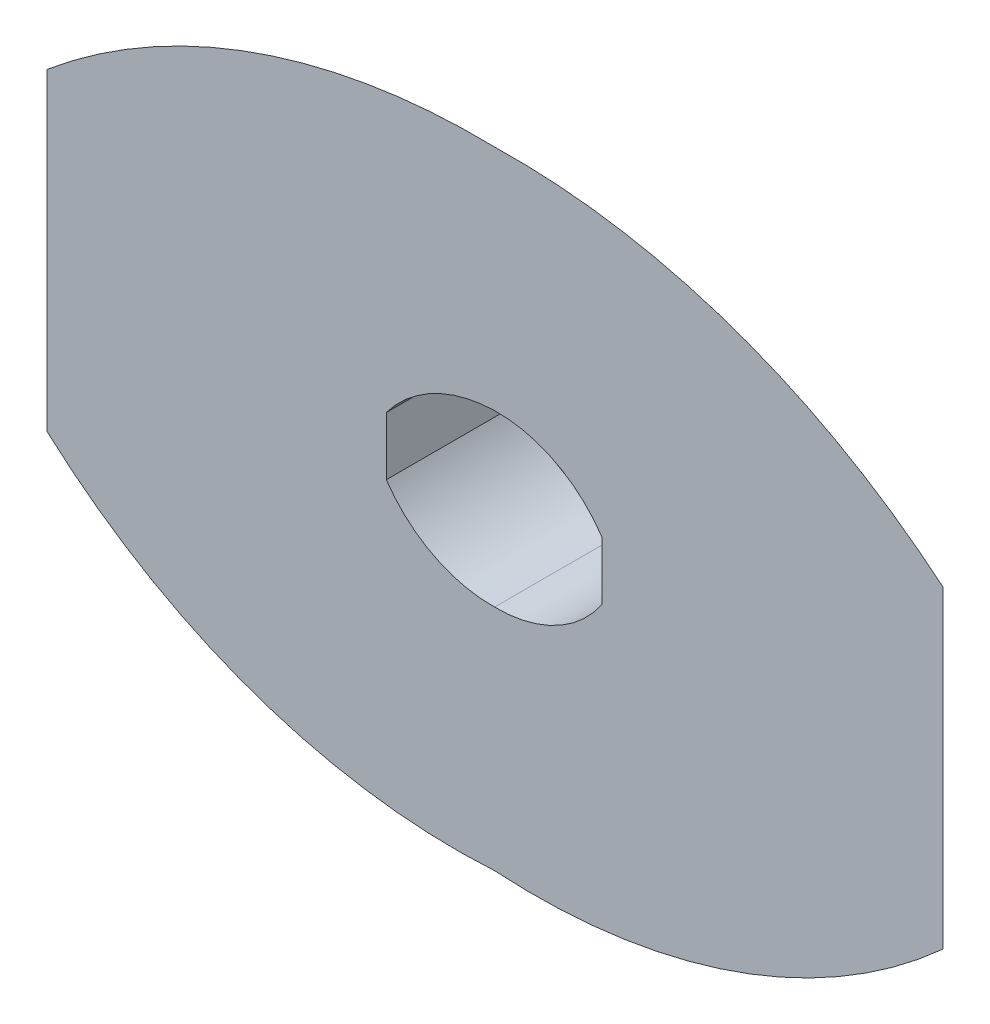
ISO-10303-21;
HEADER;
FILE_DESCRIPTION(('STEP AP214'),'2;1');
FILE_NAME('part.step','',(''),(''),'','','');
FILE_SCHEMA(('AUTOMOTIVE_DESIGN { 1 0 10303 214 1 1 1 1 }'));
ENDSEC;
DATA;
#1=APPLICATION_CONTEXT('core data for automotive mechanical design processes');
#2=APPLICATION_PROTOCOL_DEFINITION('international standard','automotive_design',2000,#1);
#3=PRODUCT_CONTEXT('',#1,'mechanical');
#4=PRODUCT('Part','Part','',(#3));
#5=PRODUCT_RELATED_PRODUCT_CATEGORY('part','',(#4));
#6=PRODUCT_DEFINITION_FORMATION('','',#4);
#7=PRODUCT_DEFINITION_CONTEXT('part definition',#1,'design');
#8=PRODUCT_DEFINITION('design','',#6,#7);
#9=PRODUCT_DEFINITION_SHAPE('','',#8);
#10=(LENGTH_UNIT() NAMED_UNIT(*) SI_UNIT(.MILLI.,.METRE.));
#11=(NAMED_UNIT(*) PLANE_ANGLE_UNIT() SI_UNIT($,.RADIAN.));
#12=(NAMED_UNIT(*) SI_UNIT($,.STERADIAN.) SOLID_ANGLE_UNIT());
#13=UNCERTAINTY_MEASURE_WITH_UNIT(LENGTH_MEASURE(1.E-05),#10,'distance_accuracy_value','');
#14=(GEOMETRIC_REPRESENTATION_CONTEXT(3) GLOBAL_UNCERTAINTY_ASSIGNED_CONTEXT((#13)) GLOBAL_UNIT_ASSIGNED_CONTEXT((#10,
#11,#12)) REPRESENTATION_CONTEXT('',''));
#15=CARTESIAN_POINT('',(0.,0.,0.));
#16=DIRECTION('',(0.,0.,1.));
#17=DIRECTION('',(1.,0.,0.));
#18=AXIS2_PLACEMENT_3D('',#15,#16,#17);
#19=CARTESIAN_POINT('',(24.6149633025542,-9.10927045909589,30.));
#20=DIRECTION('',(0.,0.,-1.));
#21=DIRECTION('',(-1.,0.,0.));
#22=AXIS2_PLACEMENT_3D('',#19,#20,#21);
#23=PLANE('',#22);
#24=DIRECTION('',(0.,1.,0.));
#25=VECTOR('',#24,1.);
#26=CARTESIAN_POINT('',(124.185565628365,-0.0622981882444848,30.));
#27=LINE('',#26,#25);
#28=CARTESIAN_POINT('',(124.185565628365,-35.0622981882445,30.));
#29=VERTEX_POINT('',#28);
#30=CARTESIAN_POINT('',(124.185565628365,34.9377018117555,30.));
#31=VERTEX_POINT('',#30);
#32=EDGE_CURVE('E598',#29,#31,#27,.T.);
#33=ORIENTED_EDGE('',*,*,#32,.T.);
#34=CARTESIAN_POINT('',(27.6116358621101,-80.3444625126298,30.));
#35=DIRECTION('',(0.,0.,1.));
#36=DIRECTION('',(-1.,0.,0.));
#37=AXIS2_PLACEMENT_3D('',#34,#35,#36);
#38=CIRCLE('',#37,150.387836349261);
#39=CARTESIAN_POINT('',(24.0000000000001,70.,30.));
#40=VERTEX_POINT('',#39);
#41=EDGE_CURVE('E476',#31,#40,#38,.T.);
#42=ORIENTED_EDGE('',*,*,#41,.T.);
#43=CARTESIAN_POINT('',(20.5234772685394,-80.4242207672556,30.));
#44=DIRECTION('',(0.,0.,1.));
#45=DIRECTION('',(-1.,0.,0.));
#46=AXIS2_PLACEMENT_3D('',#43,#44,#45);
#47=CIRCLE('',#46,150.464389154838);
#48=CARTESIAN_POINT('',(-76.,35.,30.));
#49=VERTEX_POINT('',#48);
#50=EDGE_CURVE('E463',#40,#49,#47,.T.);
#51=ORIENTED_EDGE('',*,*,#50,.T.);
#52=DIRECTION('',(0.,-1.,0.));
#53=VECTOR('',#52,1.);
#54=CARTESIAN_POINT('',(-76.,0.,30.));
#55=LINE('',#54,#53);
#56=CARTESIAN_POINT('',(-76.,-35.,30.));
#57=VERTEX_POINT('',#56);
#58=EDGE_CURVE('E455',#49,#57,#55,.T.);
#59=ORIENTED_EDGE('',*,*,#58,.T.);
#60=CARTESIAN_POINT('',(15.5928244593314,66.3366413123755,30.));
#61=DIRECTION('',(0.,0.,1.));
#62=DIRECTION('',(-1.,0.,0.));
#63=AXIS2_PLACEMENT_3D('',#60,#61,#62);
#64=CIRCLE('',#63,136.595608878584);
#65=CARTESIAN_POINT('',(24.0000000000001,-70.,30.));
#66=VERTEX_POINT('',#65);
#67=EDGE_CURVE('E451',#57,#66,#64,.T.);
#68=ORIENTED_EDGE('',*,*,#67,.T.);
#69=CARTESIAN_POINT('',(32.8055514157432,65.8620026125545,30.));
#70=DIRECTION('',(0.,0.,1.));
#71=DIRECTION('',(-1.,0.,0.));
#72=AXIS2_PLACEMENT_3D('',#69,#70,#71);
#73=CIRCLE('',#72,136.147058321614);
#74=EDGE_CURVE('E258',#66,#29,#73,.T.);
#75=ORIENTED_EDGE('',*,*,#74,.T.);
#76=EDGE_LOOP('',(#33,#42,#51,#59,#68,#75));
#77=FACE_BOUND('',#76,.T.);
#78=CARTESIAN_POINT('',(24.6149633025542,-9.10927045909589,30.));
#79=DIRECTION('',(0.,0.,1.));
#80=DIRECTION('',(-1.,0.,0.));
#81=AXIS2_PLACEMENT_3D('',#78,#79,#80);
#82=CIRCLE('',#81,28.1159966141357);
#83=CARTESIAN_POINT('',(48.,6.5,30.));
#84=VERTEX_POINT('',#83);
#85=CARTESIAN_POINT('',(24.,19.,30.));
#86=VERTEX_POINT('',#85);
#87=EDGE_CURVE('E240',#84,#86,#82,.T.);
#88=ORIENTED_EDGE('',*,*,#87,.F.);
#89=DIRECTION('',(0.,1.,0.));
#90=VECTOR('',#89,1.);
#91=CARTESIAN_POINT('',(48.,-6.5,30.));
#92=LINE('',#91,#90);
#93=CARTESIAN_POINT('',(48.,-6.5,30.));
#94=VERTEX_POINT('',#93);
#95=EDGE_CURVE('E275',#94,#84,#92,.T.);
#96=ORIENTED_EDGE('',*,*,#95,.F.);
#97=CARTESIAN_POINT('',(24.3946012008228,9.53236569442032,30.));
#98=DIRECTION('',(0.,0.,1.));
#99=DIRECTION('',(-1.,0.,0.));
#100=AXIS2_PLACEMENT_3D('',#97,#98,#99);
#101=CIRCLE('',#100,28.5350942214639);
#102=CARTESIAN_POINT('',(24.,-19.,30.));
#103=VERTEX_POINT('',#102);
#104=EDGE_CURVE('E272',#103,#94,#101,.T.);
#105=ORIENTED_EDGE('',*,*,#104,.F.);
#106=CARTESIAN_POINT('',(23.4409098940042,9.51422638055253,30.));
#107=DIRECTION('',(0.,0.,1.));
#108=DIRECTION('',(1.,0.,0.));
#109=AXIS2_PLACEMENT_3D('',#106,#107,#108);
#110=CIRCLE('',#109,28.5197070081027);
#111=CARTESIAN_POINT('',(-0.188408081401335,-6.45540166286783,30.));
#112=VERTEX_POINT('',#111);
#113=EDGE_CURVE('E267',#112,#103,#110,.T.);
#114=ORIENTED_EDGE('',*,*,#113,.F.);
#115=DIRECTION('',(0.,-1.,0.));
#116=VECTOR('',#115,1.);
#117=CARTESIAN_POINT('',(-0.188408081401328,-6.45540166286783,30.));
#118=LINE('',#117,#116);
#119=CARTESIAN_POINT('',(-0.188408081401328,6.54459833713217,30.));
#120=VERTEX_POINT('',#119);
#121=EDGE_CURVE('E263',#120,#112,#118,.T.);
#122=ORIENTED_EDGE('',*,*,#121,.F.);
#123=CARTESIAN_POINT('',(24.6789306964681,-12.0331470036309,30.));
#124=DIRECTION('',(0.,0.,1.));
#125=DIRECTION('',(-1.,0.,0.));
#126=AXIS2_PLACEMENT_3D('',#123,#124,#125);
#127=CIRCLE('',#126,31.040572801409);
#128=EDGE_CURVE('E249',#86,#120,#127,.T.);
#129=ORIENTED_EDGE('',*,*,#128,.F.);
#130=EDGE_LOOP('',(#88,#96,#105,#114,#122,#129));
#131=FACE_BOUND('',#130,.T.);
#132=ADVANCED_FACE('F165',(#77,#131),#23,.F.);
#133=CARTESIAN_POINT('',(48.,-6.5,0.));
#134=DIRECTION('',(0.366392407074841,0.,-0.93046042583116));
#135=DIRECTION('',(0.,1.,0.));
#136=AXIS2_PLACEMENT_3D('',#133,#134,#135);
#137=PLANE('',#136);
#138=CARTESIAN_POINT('',(48.,-6.50000000000001,0.));
#139=DIRECTION('',(0.,1.,0.));
#140=VECTOR('',#139,1.);
#141=LINE('',#138,#140);
#142=CARTESIAN_POINT('',(48.,-6.5,0.));
#143=VERTEX_POINT('',#142);
#144=CARTESIAN_POINT('',(48.,6.5,0.));
#145=VERTEX_POINT('',#144);
#146=EDGE_CURVE('E12',#143,#145,#141,.T.);
#147=ORIENTED_EDGE('',*,*,#146,.T.);
#148=DIRECTION('',(0.878957023448894,0.328087315911214,0.34611163526821));
#149=VECTOR('',#148,1.);
#150=CARTESIAN_POINT('',(86.0927828141823,20.7188509058777,15.));
#151=LINE('',#150,#149);
#152=EDGE_CURVE('E527',#145,#31,#151,.T.);
#153=ORIENTED_EDGE('',*,*,#152,.T.);
#154=ORIENTED_EDGE('',*,*,#32,.F.);
#155=DIRECTION('',(0.878541878238959,-0.329369151362959,0.345948161305717));
#156=VECTOR('',#155,1.);
#157=CARTESIAN_POINT('',(86.0927828141823,-20.7811490941222,15.));
#158=LINE('',#157,#156);
#159=EDGE_CURVE('E577',#143,#29,#158,.T.);
#160=ORIENTED_EDGE('',*,*,#159,.F.);
#161=EDGE_LOOP('',(#147,#153,#154,#160));
#162=FACE_BOUND('',#161,.T.);
#163=ADVANCED_FACE('F301',(#162),#137,.T.);
#164=CARTESIAN_POINT('',(48.,6.5,0.));
#165=CARTESIAN_POINT('',(124.185565628365,34.9377018117555,30.));
#166=CARTESIAN_POINT('',(46.6938965379214,8.45673958442884,0.));
#167=CARTESIAN_POINT('',(117.255780952948,40.7429063068397,30.));
#168=CARTESIAN_POINT('',(43.5882224493372,12.0406958862123,0.));
#169=CARTESIAN_POINT('',(102.346855193951,51.1005017731215,30.));
#170=CARTESIAN_POINT('',(37.7398565174825,16.0905245135667,0.));
#171=CARTESIAN_POINT('',(77.5589852438945,62.3730348569333,30.));
#172=CARTESIAN_POINT('',(31.0689807560508,18.5611342681323,0.));
#173=CARTESIAN_POINT('',(51.1514301850644,69.0175464718968,30.));
#174=CARTESIAN_POINT('',(26.3520391654009,19.05145696595,0.));
#175=CARTESIAN_POINT('',(33.0374322728898,70.2171008758997,30.));
#176=CARTESIAN_POINT('',(24.,19.,0.));
#177=CARTESIAN_POINT('',(24.0000000000001,70.,30.));
#178=B_SPLINE_SURFACE_WITH_KNOTS('',3,1,((#164,#165),(#166,#167),(#168,#169),(#170,#171),(#172,
#173),(#174,#175),(#176,#177)),.UNSPECIFIED.,.F.,.F.,.F.,(4,1,1,1,4),(2,2),(0.,0.25,0.5,0.75,
1.),(0.,1.),.UNSPECIFIED.);
#179=CARTESIAN_POINT('',(48.,6.5,0.));
#180=CARTESIAN_POINT('',(46.6938965379214,8.45673958442884,0.));
#181=CARTESIAN_POINT('',(43.5882224493372,12.0406958862123,0.));
#182=CARTESIAN_POINT('',(37.7398565174825,16.0905245135667,0.));
#183=CARTESIAN_POINT('',(31.0689807560508,18.5611342681323,0.));
#184=CARTESIAN_POINT('',(26.3520391654009,19.05145696595,0.));
#185=CARTESIAN_POINT('',(24.,19.,0.));
#186=B_SPLINE_CURVE_WITH_KNOTS('',3,(#179,#180,#181,#182,#183,#184,#185),.UNSPECIFIED.,.F.,.F.,
(4,1,1,1,4),(0.,0.25,0.5,0.75,1.),.UNSPECIFIED.);
#187=CARTESIAN_POINT('',(24.,19.,0.));
#188=VERTEX_POINT('',#187);
#189=EDGE_CURVE('E192',#145,#188,#186,.T.);
#190=DIRECTION('',(0.,0.86193421515777,0.507020126563394));
#191=VECTOR('',#190,1.);
#192=CARTESIAN_POINT('',(24.0000000000001,44.5,15.));
#193=LINE('',#192,#191);
#194=EDGE_CURVE('E333',#188,#40,#193,.T.);
#195=ORIENTED_EDGE('',*,*,#189,.T.);
#196=ORIENTED_EDGE('',*,*,#194,.T.);
#197=ORIENTED_EDGE('',*,*,#41,.F.);
#198=ORIENTED_EDGE('',*,*,#152,.F.);
#199=EDGE_LOOP('',(#195,#196,#197,#198));
#200=FACE_BOUND('',#199,.T.);
#201=ADVANCED_FACE('F289',(#200),#178,.T.);
#202=CARTESIAN_POINT('',(24.,19.,0.));
#203=CARTESIAN_POINT('',(24.0000000000001,70.,30.));
#204=CARTESIAN_POINT('',(21.6536450407856,18.9486673908246,0.));
#205=CARTESIAN_POINT('',(14.980008115769,70.2084651438656,30.));
#206=CARTESIAN_POINT('',(16.9726874032219,18.3117212435205,0.));
#207=CARTESIAN_POINT('',(-3.09745611332407,68.9988214724622,30.));
#208=CARTESIAN_POINT('',(10.3460738242946,15.801281815313,0.));
#209=CARTESIAN_POINT('',(-29.4513308405576,62.3609452587364,30.));
#210=CARTESIAN_POINT('',(4.45356248726267,11.8652147693808,0.));
#211=CARTESIAN_POINT('',(-54.19256774279,51.1155324021493,30.));
#212=CARTESIAN_POINT('',(1.21621855560144,8.42476871292722,0.));
#213=CARTESIAN_POINT('',(-69.0787373917978,40.7879042162173,30.));
#214=CARTESIAN_POINT('',(-0.188408081401321,6.54459833713218,0.));
#215=CARTESIAN_POINT('',(-76.,35.,30.));
#216=B_SPLINE_SURFACE_WITH_KNOTS('',3,1,((#202,#203),(#204,#205),(#206,#207),(#208,#209),(#210,
#211),(#212,#213),(#214,#215)),.UNSPECIFIED.,.F.,.F.,.F.,(4,1,1,1,4),(2,2),(0.,0.25,0.5,0.75,
1.),(0.,1.),.UNSPECIFIED.);
#217=CARTESIAN_POINT('',(24.,19.,0.));
#218=CARTESIAN_POINT('',(21.6536450407856,18.9486673908246,0.));
#219=CARTESIAN_POINT('',(16.9726874032219,18.3117212435205,0.));
#220=CARTESIAN_POINT('',(10.3460738242946,15.801281815313,0.));
#221=CARTESIAN_POINT('',(4.45356248726267,11.8652147693808,0.));
#222=CARTESIAN_POINT('',(1.21621855560144,8.42476871292722,0.));
#223=CARTESIAN_POINT('',(-0.188408081401321,6.54459833713218,0.));
#224=B_SPLINE_CURVE_WITH_KNOTS('',3,(#217,#218,#219,#220,#221,#222,#223),.UNSPECIFIED.,.F.,.F.,
(4,1,1,1,4),(0.,0.25,0.5,0.75,1.),.UNSPECIFIED.);
#225=CARTESIAN_POINT('',(-0.188408081401328,6.54459833713217,0.));
#226=VERTEX_POINT('',#225);
#227=EDGE_CURVE('E255',#188,#226,#224,.T.);
#228=DIRECTION('',(-0.877910854277108,0.329518288040564,0.347404993903735));
#229=VECTOR('',#228,1.);
#230=CARTESIAN_POINT('',(-38.0942040407007,20.7722991685661,15.));
#231=LINE('',#230,#229);
#232=EDGE_CURVE('E355',#226,#49,#231,.T.);
#233=ORIENTED_EDGE('',*,*,#227,.T.);
#234=ORIENTED_EDGE('',*,*,#232,.T.);
#235=ORIENTED_EDGE('',*,*,#50,.F.);
#236=ORIENTED_EDGE('',*,*,#194,.F.);
#237=EDGE_LOOP('',(#233,#234,#235,#236));
#238=FACE_BOUND('',#237,.T.);
#239=ADVANCED_FACE('F300',(#238),#216,.T.);
#240=CARTESIAN_POINT('',(-0.188408081401328,6.54459833713216,0.));
#241=DIRECTION('',(-0.367955611924982,0.,-0.929843356513834));
#242=DIRECTION('',(0.,-1.,0.));
#243=AXIS2_PLACEMENT_3D('',#240,#241,#242);
#244=PLANE('',#243);
#245=CARTESIAN_POINT('',(-0.188408081401328,6.54459833713216,0.));
#246=DIRECTION('',(0.,-1.,0.));
#247=VECTOR('',#246,1.);
#248=LINE('',#245,#247);
#249=CARTESIAN_POINT('',(-0.188408081401335,-6.45540166286783,0.));
#250=VERTEX_POINT('',#249);
#251=EDGE_CURVE('E652',#226,#250,#248,.T.);
#252=ORIENTED_EDGE('',*,*,#251,.T.);
#253=DIRECTION('',(-0.877611730084075,-0.330438574065345,0.347286625121813));
#254=VECTOR('',#253,1.);
#255=CARTESIAN_POINT('',(-38.0942040407007,-20.7277008314339,15.));
#256=LINE('',#255,#254);
#257=EDGE_CURVE('E404',#250,#57,#256,.T.);
#258=ORIENTED_EDGE('',*,*,#257,.T.);
#259=ORIENTED_EDGE('',*,*,#58,.F.);
#260=ORIENTED_EDGE('',*,*,#232,.F.);
#261=EDGE_LOOP('',(#252,#258,#259,#260));
#262=FACE_BOUND('',#261,.T.);
#263=ADVANCED_FACE('F371',(#262),#244,.T.);
#264=CARTESIAN_POINT('',(-0.188408081401338,-6.45540166286782,0.));
#265=CARTESIAN_POINT('',(-76.,-35.,30.));
#266=CARTESIAN_POINT('',(1.13717086581128,-8.41678275202195,0.));
#267=CARTESIAN_POINT('',(-69.2735834337424,-41.0796517805878,30.));
#268=CARTESIAN_POINT('',(4.27897749500094,-12.0078096576078,0.));
#269=CARTESIAN_POINT('',(-54.6066109152767,-51.8953989817288,30.));
#270=CARTESIAN_POINT('',(10.1743380561867,-16.0662860304742,0.));
#271=CARTESIAN_POINT('',(-29.830832347918,-63.4452352797661,30.));
#272=CARTESIAN_POINT('',(16.8879244759261,-18.5470649404523,0.));
#273=CARTESIAN_POINT('',(-3.26011421742076,-69.8666728259783,30.));
#274=CARTESIAN_POINT('',(21.6331409796556,-19.0464079734411,0.));
#275=CARTESIAN_POINT('',(14.9503903934945,-70.5580426201207,30.));
#276=CARTESIAN_POINT('',(24.,-19.,0.));
#277=CARTESIAN_POINT('',(24.0000000000001,-70.,30.));
#278=B_SPLINE_SURFACE_WITH_KNOTS('',3,1,((#264,#265),(#266,#267),(#268,#269),(#270,#271),(#272,
#273),(#274,#275),(#276,#277)),.UNSPECIFIED.,.F.,.F.,.F.,(4,1,1,1,4),(2,2),(0.,0.25,0.5,0.75,
1.),(0.,1.),.UNSPECIFIED.);
#279=CARTESIAN_POINT('',(-0.188408081401338,-6.45540166286782,0.));
#280=CARTESIAN_POINT('',(1.13717086581128,-8.41678275202195,0.));
#281=CARTESIAN_POINT('',(4.27897749500094,-12.0078096576078,0.));
#282=CARTESIAN_POINT('',(10.1743380561867,-16.0662860304742,0.));
#283=CARTESIAN_POINT('',(16.8879244759261,-18.5470649404523,0.));
#284=CARTESIAN_POINT('',(21.6331409796556,-19.0464079734411,0.));
#285=CARTESIAN_POINT('',(24.,-19.,0.));
#286=B_SPLINE_CURVE_WITH_KNOTS('',3,(#279,#280,#281,#282,#283,#284,#285),.UNSPECIFIED.,.F.,.F.,
(4,1,1,1,4),(0.,0.25,0.5,0.75,1.),.UNSPECIFIED.);
#287=CARTESIAN_POINT('',(24.,-19.,0.));
#288=VERTEX_POINT('',#287);
#289=EDGE_CURVE('E648',#250,#288,#286,.T.);
#290=DIRECTION('',(0.,-0.86193421515777,0.507020126563394));
#291=VECTOR('',#290,1.);
#292=CARTESIAN_POINT('',(24.0000000000001,-44.5,15.));
#293=LINE('',#292,#291);
#294=EDGE_CURVE('E573',#288,#66,#293,.T.);
#295=ORIENTED_EDGE('',*,*,#289,.T.);
#296=ORIENTED_EDGE('',*,*,#294,.T.);
#297=ORIENTED_EDGE('',*,*,#67,.F.);
#298=ORIENTED_EDGE('',*,*,#257,.F.);
#299=EDGE_LOOP('',(#295,#296,#297,#298));
#300=FACE_BOUND('',#299,.T.);
#301=ADVANCED_FACE('F380',(#300),#278,.T.);
#302=CARTESIAN_POINT('',(24.,-19.,0.));
#303=CARTESIAN_POINT('',(24.0000000000001,-70.,30.));
#304=CARTESIAN_POINT('',(26.3491842645924,-19.0324891017342,0.));
#305=CARTESIAN_POINT('',(33.0634632814215,-70.5874254051506,30.));
#306=CARTESIAN_POINT('',(31.0555070377086,-18.5145351176019,0.));
#307=CARTESIAN_POINT('',(51.3081336182835,-69.9428935480735,30.));
#308=CARTESIAN_POINT('',(37.710685378659,-16.0345159270251,0.));
#309=CARTESIAN_POINT('',(77.9366028873324,-63.5534908118767,30.));
#310=CARTESIAN_POINT('',(43.5577630474332,-12.0029434458704,0.));
#311=CARTESIAN_POINT('',(102.7637726922,-51.9987739214351,30.));
#312=CARTESIAN_POINT('',(46.6799909402224,-8.44352729151023,0.));
#313=CARTESIAN_POINT('',(117.452824487196,-41.1583323077602,30.));
#314=CARTESIAN_POINT('',(48.,-6.50000000000001,0.));
#315=CARTESIAN_POINT('',(124.185565628365,-35.0622981882445,30.));
#316=B_SPLINE_SURFACE_WITH_KNOTS('',3,1,((#302,#303),(#304,#305),(#306,#307),(#308,#309),(#310,
#311),(#312,#313),(#314,#315)),.UNSPECIFIED.,.F.,.F.,.F.,(4,1,1,1,4),(2,2),(0.,0.25,0.5,0.75,
1.),(0.,1.),.UNSPECIFIED.);
#317=CARTESIAN_POINT('',(24.,-19.,0.));
#318=CARTESIAN_POINT('',(26.3491842645924,-19.0324891017342,0.));
#319=CARTESIAN_POINT('',(31.0555070377086,-18.5145351176019,0.));
#320=CARTESIAN_POINT('',(37.710685378659,-16.0345159270251,0.));
#321=CARTESIAN_POINT('',(43.5577630474332,-12.0029434458704,0.));
#322=CARTESIAN_POINT('',(46.6799909402224,-8.44352729151023,0.));
#323=CARTESIAN_POINT('',(48.,-6.50000000000001,0.));
#324=B_SPLINE_CURVE_WITH_KNOTS('',3,(#317,#318,#319,#320,#321,#322,#323),.UNSPECIFIED.,.F.,.F.,
(4,1,1,1,4),(0.,0.25,0.5,0.75,1.),.UNSPECIFIED.);
#325=EDGE_CURVE('E177',#288,#143,#324,.T.);
#326=ORIENTED_EDGE('',*,*,#325,.T.);
#327=ORIENTED_EDGE('',*,*,#159,.T.);
#328=ORIENTED_EDGE('',*,*,#74,.F.);
#329=ORIENTED_EDGE('',*,*,#294,.F.);
#330=EDGE_LOOP('',(#326,#327,#328,#329));
#331=FACE_BOUND('',#330,.T.);
#332=ADVANCED_FACE('F419',(#331),#316,.T.);
#333=CARTESIAN_POINT('',(24.6149633025542,-9.10927045909589,30.));
#334=DIRECTION('',(0.,0.,-1.));
#335=DIRECTION('',(-1.,0.,0.));
#336=AXIS2_PLACEMENT_3D('',#333,#334,#335);
#337=CYLINDRICAL_SURFACE('',#336,28.1159966141357);
#338=ORIENTED_EDGE('',*,*,#189,.F.);
#339=DIRECTION('',(0.,0.,-1.));
#340=VECTOR('',#339,1.);
#341=CARTESIAN_POINT('',(48.,6.5,30.));
#342=LINE('',#341,#340);
#343=EDGE_CURVE('E244',#84,#145,#342,.T.);
#344=ORIENTED_EDGE('',*,*,#343,.F.);
#345=ORIENTED_EDGE('',*,*,#87,.T.);
#346=DIRECTION('',(0.,0.,-1.));
#347=VECTOR('',#346,1.);
#348=CARTESIAN_POINT('',(24.,19.,30.));
#349=LINE('',#348,#347);
#350=EDGE_CURVE('E243',#86,#188,#349,.T.);
#351=ORIENTED_EDGE('',*,*,#350,.T.);
#352=EDGE_LOOP('',(#338,#344,#345,#351));
#353=FACE_BOUND('',#352,.T.);
#354=ADVANCED_FACE('F242',(#353),#337,.F.);
#355=CARTESIAN_POINT('',(24.6789306964681,-12.0331470036309,30.));
#356=DIRECTION('',(0.,0.,-1.));
#357=DIRECTION('',(-1.,0.,0.));
#358=AXIS2_PLACEMENT_3D('',#355,#356,#357);
#359=CYLINDRICAL_SURFACE('',#358,31.040572801409);
#360=ORIENTED_EDGE('',*,*,#227,.F.);
#361=ORIENTED_EDGE('',*,*,#350,.F.);
#362=ORIENTED_EDGE('',*,*,#128,.T.);
#363=DIRECTION('',(0.,0.,-1.));
#364=VECTOR('',#363,1.);
#365=CARTESIAN_POINT('',(-0.188408081401328,6.54459833713217,30.));
#366=LINE('',#365,#364);
#367=EDGE_CURVE('E259',#120,#226,#366,.T.);
#368=ORIENTED_EDGE('',*,*,#367,.T.);
#369=EDGE_LOOP('',(#360,#361,#362,#368));
#370=FACE_BOUND('',#369,.T.);
#371=ADVANCED_FACE('F252',(#370),#359,.F.);
#372=CARTESIAN_POINT('',(-0.188408081401328,-6.45540166286783,30.));
#373=DIRECTION('',(1.,0.,0.));
#374=DIRECTION('',(0.,0.,-1.));
#375=AXIS2_PLACEMENT_3D('',#372,#373,#374);
#376=PLANE('',#375);
#377=ORIENTED_EDGE('',*,*,#251,.F.);
#378=ORIENTED_EDGE('',*,*,#367,.F.);
#379=ORIENTED_EDGE('',*,*,#121,.T.);
#380=DIRECTION('',(0.,0.,-1.));
#381=VECTOR('',#380,1.);
#382=CARTESIAN_POINT('',(-0.188408081401335,-6.45540166286783,30.));
#383=LINE('',#382,#381);
#384=EDGE_CURVE('E570',#112,#250,#383,.T.);
#385=ORIENTED_EDGE('',*,*,#384,.T.);
#386=EDGE_LOOP('',(#377,#378,#379,#385));
#387=FACE_BOUND('',#386,.T.);
#388=ADVANCED_FACE('F675',(#387),#376,.T.);
#389=CARTESIAN_POINT('',(23.4409098940042,9.51422638055253,30.));
#390=DIRECTION('',(0.,0.,-1.));
#391=DIRECTION('',(-1.,0.,0.));
#392=AXIS2_PLACEMENT_3D('',#389,#390,#391);
#393=CYLINDRICAL_SURFACE('',#392,28.5197070081027);
#394=ORIENTED_EDGE('',*,*,#289,.F.);
#395=ORIENTED_EDGE('',*,*,#384,.F.);
#396=ORIENTED_EDGE('',*,*,#113,.T.);
#397=DIRECTION('',(0.,0.,-1.));
#398=VECTOR('',#397,1.);
#399=CARTESIAN_POINT('',(24.,-19.,30.));
#400=LINE('',#399,#398);
#401=EDGE_CURVE('E562',#103,#288,#400,.T.);
#402=ORIENTED_EDGE('',*,*,#401,.T.);
#403=EDGE_LOOP('',(#394,#395,#396,#402));
#404=FACE_BOUND('',#403,.T.);
#405=ADVANCED_FACE('F551',(#404),#393,.F.);
#406=CARTESIAN_POINT('',(24.3946012008228,9.53236569442032,30.));
#407=DIRECTION('',(0.,0.,-1.));
#408=DIRECTION('',(-1.,0.,0.));
#409=AXIS2_PLACEMENT_3D('',#406,#407,#408);
#410=CYLINDRICAL_SURFACE('',#409,28.5350942214639);
#411=ORIENTED_EDGE('',*,*,#325,.F.);
#412=ORIENTED_EDGE('',*,*,#401,.F.);
#413=ORIENTED_EDGE('',*,*,#104,.T.);
#414=DIRECTION('',(0.,0.,-1.));
#415=VECTOR('',#414,1.);
#416=CARTESIAN_POINT('',(48.,-6.5,30.));
#417=LINE('',#416,#415);
#418=EDGE_CURVE('E184',#94,#143,#417,.T.);
#419=ORIENTED_EDGE('',*,*,#418,.T.);
#420=EDGE_LOOP('',(#411,#412,#413,#419));
#421=FACE_BOUND('',#420,.T.);
#422=ADVANCED_FACE('F547',(#421),#410,.F.);
#423=CARTESIAN_POINT('',(48.,-6.5,30.));
#424=DIRECTION('',(-1.,0.,0.));
#425=DIRECTION('',(0.,0.,1.));
#426=AXIS2_PLACEMENT_3D('',#423,#424,#425);
#427=PLANE('',#426);
#428=ORIENTED_EDGE('',*,*,#146,.F.);
#429=ORIENTED_EDGE('',*,*,#418,.F.);
#430=ORIENTED_EDGE('',*,*,#95,.T.);
#431=ORIENTED_EDGE('',*,*,#343,.T.);
#432=EDGE_LOOP('',(#428,#429,#430,#431));
#433=FACE_BOUND('',#432,.T.);
#434=ADVANCED_FACE('F538',(#433),#427,.T.);
#435=CLOSED_SHELL('',(#132,#163,#201,#239,#263,#301,#332,#354,#371,#388,#405,#422,#434));
#436=MANIFOLD_SOLID_BREP('B2',#435);
#437=ADVANCED_BREP_SHAPE_REPRESENTATION('',(#18,#436),#14);
#438=SHAPE_DEFINITION_REPRESENTATION(#9,#437);
ENDSEC;
END-ISO-10303-21;
